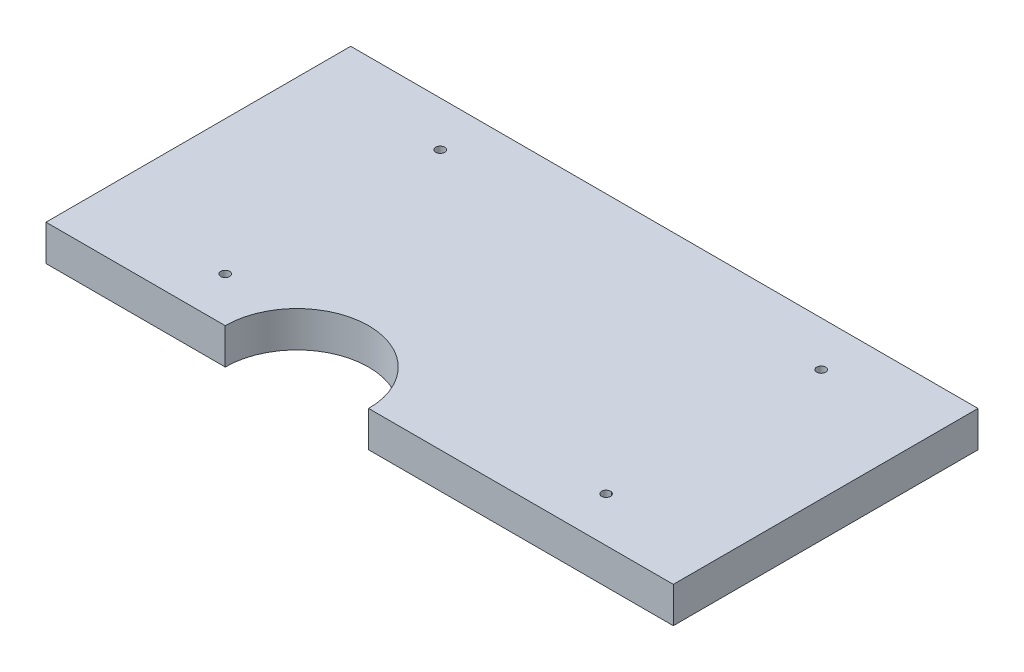
ISO-10303-21;
HEADER;
FILE_DESCRIPTION(('STEP AP214'),'2;1');
FILE_NAME('part.step','',(''),(''),'','','');
FILE_SCHEMA(('AUTOMOTIVE_DESIGN { 1 0 10303 214 1 1 1 1 }'));
ENDSEC;
DATA;
#1=APPLICATION_CONTEXT('core data for automotive mechanical design processes');
#2=APPLICATION_PROTOCOL_DEFINITION('international standard','automotive_design',2000,#1);
#3=PRODUCT_CONTEXT('',#1,'mechanical');
#4=PRODUCT('Part','Part','',(#3));
#5=PRODUCT_RELATED_PRODUCT_CATEGORY('part','',(#4));
#6=PRODUCT_DEFINITION_FORMATION('','',#4);
#7=PRODUCT_DEFINITION_CONTEXT('part definition',#1,'design');
#8=PRODUCT_DEFINITION('design','',#6,#7);
#9=PRODUCT_DEFINITION_SHAPE('','',#8);
#10=(LENGTH_UNIT() NAMED_UNIT(*) SI_UNIT(.MILLI.,.METRE.));
#11=(NAMED_UNIT(*) PLANE_ANGLE_UNIT() SI_UNIT($,.RADIAN.));
#12=(NAMED_UNIT(*) SI_UNIT($,.STERADIAN.) SOLID_ANGLE_UNIT());
#13=UNCERTAINTY_MEASURE_WITH_UNIT(LENGTH_MEASURE(1.E-05),#10,'distance_accuracy_value','');
#14=(GEOMETRIC_REPRESENTATION_CONTEXT(3) GLOBAL_UNCERTAINTY_ASSIGNED_CONTEXT((#13)) GLOBAL_UNIT_ASSIGNED_CONTEXT((#10,
#11,#12)) REPRESENTATION_CONTEXT('',''));
#15=CARTESIAN_POINT('',(0.,0.,0.));
#16=DIRECTION('',(0.,0.,1.));
#17=DIRECTION('',(1.,0.,0.));
#18=AXIS2_PLACEMENT_3D('',#15,#16,#17);
#19=CARTESIAN_POINT('',(-6.67533906368843,8.,25.2536740033262));
#20=DIRECTION('',(0.,1.,0.));
#21=DIRECTION('',(0.,0.,1.));
#22=AXIS2_PLACEMENT_3D('',#19,#20,#21);
#23=PLANE('',#22);
#24=CARTESIAN_POINT('',(52.3246609363116,8.,-32.7463259966738));
#25=DIRECTION('',(0.,1.,0.));
#26=DIRECTION('',(0.,0.,1.));
#27=AXIS2_PLACEMENT_3D('',#24,#25,#26);
#28=CIRCLE('',#27,0.999999999999998);
#29=CARTESIAN_POINT('',(52.3246609363116,8.,-31.7463259966738));
#30=VERTEX_POINT('',#29);
#31=EDGE_CURVE('E188',#30,#30,#28,.T.);
#32=ORIENTED_EDGE('',*,*,#31,.F.);
#33=EDGE_LOOP('',(#32));
#34=FACE_BOUND('',#33,.T.);
#35=CARTESIAN_POINT('',(-32.6753390636884,8.,-32.7463259966738));
#36=DIRECTION('',(0.,1.,0.));
#37=DIRECTION('',(0.,0.,1.));
#38=AXIS2_PLACEMENT_3D('',#35,#36,#37);
#39=CIRCLE('',#38,0.999999999999998);
#40=CARTESIAN_POINT('',(-32.6753390636884,8.,-31.7463259966738));
#41=VERTEX_POINT('',#40);
#42=EDGE_CURVE('E121',#41,#41,#39,.T.);
#43=ORIENTED_EDGE('',*,*,#42,.F.);
#44=EDGE_LOOP('',(#43));
#45=FACE_BOUND('',#44,.T.);
#46=DIRECTION('',(0.,0.,1.));
#47=VECTOR('',#46,1.);
#48=CARTESIAN_POINT('',(-62.6753390636884,8.,-42.7463259966738));
#49=LINE('',#48,#47);
#50=CARTESIAN_POINT('',(-62.6753390636884,8.,-42.7463259966738));
#51=VERTEX_POINT('',#50);
#52=CARTESIAN_POINT('',(-62.6753390636884,8.,25.2536740033262));
#53=VERTEX_POINT('',#52);
#54=EDGE_CURVE('E128',#51,#53,#49,.T.);
#55=ORIENTED_EDGE('',*,*,#54,.T.);
#56=DIRECTION('',(1.,0.,0.));
#57=VECTOR('',#56,1.);
#58=CARTESIAN_POINT('',(-62.6753390636884,8.,25.2536740033262));
#59=LINE('',#58,#57);
#60=CARTESIAN_POINT('',(-22.6753390636884,8.,25.2536740033262));
#61=VERTEX_POINT('',#60);
#62=EDGE_CURVE('E86',#53,#61,#59,.T.);
#63=ORIENTED_EDGE('',*,*,#62,.T.);
#64=CARTESIAN_POINT('',(-6.67533906368843,8.,25.2536740033262));
#65=DIRECTION('',(0.,-1.,0.));
#66=DIRECTION('',(0.,0.,1.));
#67=AXIS2_PLACEMENT_3D('',#64,#65,#66);
#68=CIRCLE('',#67,16.);
#69=CARTESIAN_POINT('',(9.32466093631158,8.,25.2536740033262));
#70=VERTEX_POINT('',#69);
#71=EDGE_CURVE('E99',#61,#70,#68,.T.);
#72=ORIENTED_EDGE('',*,*,#71,.T.);
#73=DIRECTION('',(1.,0.,0.));
#74=VECTOR('',#73,1.);
#75=CARTESIAN_POINT('',(9.32466093631158,8.,25.2536740033262));
#76=LINE('',#75,#74);
#77=CARTESIAN_POINT('',(77.3246609363116,8.,25.2536740033262));
#78=VERTEX_POINT('',#77);
#79=EDGE_CURVE('E93',#70,#78,#76,.T.);
#80=ORIENTED_EDGE('',*,*,#79,.T.);
#81=DIRECTION('',(0.,0.,-1.));
#82=VECTOR('',#81,1.);
#83=CARTESIAN_POINT('',(77.3246609363116,8.,-42.7463259966738));
#84=LINE('',#83,#82);
#85=CARTESIAN_POINT('',(77.3246609363116,8.,-42.7463259966738));
#86=VERTEX_POINT('',#85);
#87=EDGE_CURVE('E97',#78,#86,#84,.T.);
#88=ORIENTED_EDGE('',*,*,#87,.T.);
#89=DIRECTION('',(-1.,0.,0.));
#90=VECTOR('',#89,1.);
#91=CARTESIAN_POINT('',(-62.6753390636884,8.,-42.7463259966738));
#92=LINE('',#91,#90);
#93=EDGE_CURVE('E49',#86,#51,#92,.T.);
#94=ORIENTED_EDGE('',*,*,#93,.T.);
#95=EDGE_LOOP('',(#55,#63,#72,#80,#88,#94));
#96=FACE_BOUND('',#95,.T.);
#97=CARTESIAN_POINT('',(-32.6753390636884,8.,15.2536740033262));
#98=DIRECTION('',(0.,1.,0.));
#99=DIRECTION('',(0.,0.,1.));
#100=AXIS2_PLACEMENT_3D('',#97,#98,#99);
#101=CIRCLE('',#100,0.999999999999998);
#102=CARTESIAN_POINT('',(-32.6753390636884,8.,16.2536740033262));
#103=VERTEX_POINT('',#102);
#104=EDGE_CURVE('E194',#103,#103,#101,.T.);
#105=ORIENTED_EDGE('',*,*,#104,.F.);
#106=EDGE_LOOP('',(#105));
#107=FACE_BOUND('',#106,.T.);
#108=CARTESIAN_POINT('',(52.3246609363116,8.,15.2536740033262));
#109=DIRECTION('',(0.,1.,0.));
#110=DIRECTION('',(0.,0.,1.));
#111=AXIS2_PLACEMENT_3D('',#108,#109,#110);
#112=CIRCLE('',#111,0.999999999999998);
#113=CARTESIAN_POINT('',(52.3246609363116,8.,16.2536740033262));
#114=VERTEX_POINT('',#113);
#115=EDGE_CURVE('E179',#114,#114,#112,.T.);
#116=ORIENTED_EDGE('',*,*,#115,.F.);
#117=EDGE_LOOP('',(#116));
#118=FACE_BOUND('',#117,.T.);
#119=ADVANCED_FACE('F32',(#34,#45,#96,#107,#118),#23,.T.);
#120=CARTESIAN_POINT('',(-6.67533906368843,0.,25.2536740033262));
#121=DIRECTION('',(0.,1.,0.));
#122=DIRECTION('',(0.,0.,1.));
#123=AXIS2_PLACEMENT_3D('',#120,#121,#122);
#124=PLANE('',#123);
#125=DIRECTION('',(0.,0.,1.));
#126=VECTOR('',#125,1.);
#127=CARTESIAN_POINT('',(-62.6753390636884,0.,-42.7463259966738));
#128=LINE('',#127,#126);
#129=CARTESIAN_POINT('',(-62.6753390636884,0.,-42.7463259966738));
#130=VERTEX_POINT('',#129);
#131=CARTESIAN_POINT('',(-62.6753390636884,0.,25.2536740033262));
#132=VERTEX_POINT('',#131);
#133=EDGE_CURVE('E117',#130,#132,#128,.T.);
#134=ORIENTED_EDGE('',*,*,#133,.F.);
#135=DIRECTION('',(-1.,0.,0.));
#136=VECTOR('',#135,1.);
#137=CARTESIAN_POINT('',(-62.6753390636884,0.,-42.7463259966738));
#138=LINE('',#137,#136);
#139=CARTESIAN_POINT('',(77.3246609363116,0.,-42.7463259966738));
#140=VERTEX_POINT('',#139);
#141=EDGE_CURVE('E78',#140,#130,#138,.T.);
#142=ORIENTED_EDGE('',*,*,#141,.F.);
#143=DIRECTION('',(0.,0.,-1.));
#144=VECTOR('',#143,1.);
#145=CARTESIAN_POINT('',(77.3246609363116,0.,-42.7463259966738));
#146=LINE('',#145,#144);
#147=CARTESIAN_POINT('',(77.3246609363116,0.,25.2536740033262));
#148=VERTEX_POINT('',#147);
#149=EDGE_CURVE('E72',#148,#140,#146,.T.);
#150=ORIENTED_EDGE('',*,*,#149,.F.);
#151=DIRECTION('',(1.,0.,0.));
#152=VECTOR('',#151,1.);
#153=CARTESIAN_POINT('',(9.32466093631158,0.,25.2536740033262));
#154=LINE('',#153,#152);
#155=CARTESIAN_POINT('',(9.32466093631158,0.,25.2536740033262));
#156=VERTEX_POINT('',#155);
#157=EDGE_CURVE('E107',#156,#148,#154,.T.);
#158=ORIENTED_EDGE('',*,*,#157,.F.);
#159=CARTESIAN_POINT('',(-6.67533906368843,0.,25.2536740033262));
#160=DIRECTION('',(0.,-1.,0.));
#161=DIRECTION('',(0.,0.,1.));
#162=AXIS2_PLACEMENT_3D('',#159,#160,#161);
#163=CIRCLE('',#162,16.);
#164=CARTESIAN_POINT('',(-22.6753390636884,0.,25.2536740033262));
#165=VERTEX_POINT('',#164);
#166=EDGE_CURVE('E123',#165,#156,#163,.T.);
#167=ORIENTED_EDGE('',*,*,#166,.F.);
#168=DIRECTION('',(1.,0.,0.));
#169=VECTOR('',#168,1.);
#170=CARTESIAN_POINT('',(-62.6753390636884,0.,25.2536740033262));
#171=LINE('',#170,#169);
#172=EDGE_CURVE('E120',#132,#165,#171,.T.);
#173=ORIENTED_EDGE('',*,*,#172,.F.);
#174=EDGE_LOOP('',(#134,#142,#150,#158,#167,#173));
#175=FACE_BOUND('',#174,.T.);
#176=CARTESIAN_POINT('',(-32.6753390636884,0.,-32.7463259966738));
#177=DIRECTION('',(0.,1.,0.));
#178=DIRECTION('',(0.,0.,1.));
#179=AXIS2_PLACEMENT_3D('',#176,#177,#178);
#180=CIRCLE('',#179,0.999999999999998);
#181=CARTESIAN_POINT('',(-32.6753390636884,0.,-31.7463259966738));
#182=VERTEX_POINT('',#181);
#183=EDGE_CURVE('E197',#182,#182,#180,.T.);
#184=ORIENTED_EDGE('',*,*,#183,.T.);
#185=EDGE_LOOP('',(#184));
#186=FACE_BOUND('',#185,.T.);
#187=CARTESIAN_POINT('',(-32.6753390636884,0.,15.2536740033262));
#188=DIRECTION('',(0.,1.,0.));
#189=DIRECTION('',(0.,0.,1.));
#190=AXIS2_PLACEMENT_3D('',#187,#188,#189);
#191=CIRCLE('',#190,0.999999999999998);
#192=CARTESIAN_POINT('',(-32.6753390636884,0.,16.2536740033262));
#193=VERTEX_POINT('',#192);
#194=EDGE_CURVE('E191',#193,#193,#191,.T.);
#195=ORIENTED_EDGE('',*,*,#194,.T.);
#196=EDGE_LOOP('',(#195));
#197=FACE_BOUND('',#196,.T.);
#198=CARTESIAN_POINT('',(52.3246609363116,0.,-32.7463259966738));
#199=DIRECTION('',(0.,1.,0.));
#200=DIRECTION('',(0.,0.,1.));
#201=AXIS2_PLACEMENT_3D('',#198,#199,#200);
#202=CIRCLE('',#201,0.999999999999998);
#203=CARTESIAN_POINT('',(52.3246609363116,0.,-31.7463259966738));
#204=VERTEX_POINT('',#203);
#205=EDGE_CURVE('E185',#204,#204,#202,.T.);
#206=ORIENTED_EDGE('',*,*,#205,.T.);
#207=EDGE_LOOP('',(#206));
#208=FACE_BOUND('',#207,.T.);
#209=CARTESIAN_POINT('',(52.3246609363116,0.,15.2536740033262));
#210=DIRECTION('',(0.,1.,0.));
#211=DIRECTION('',(0.,0.,1.));
#212=AXIS2_PLACEMENT_3D('',#209,#210,#211);
#213=CIRCLE('',#212,0.999999999999998);
#214=CARTESIAN_POINT('',(52.3246609363116,0.,16.2536740033262));
#215=VERTEX_POINT('',#214);
#216=EDGE_CURVE('E182',#215,#215,#213,.T.);
#217=ORIENTED_EDGE('',*,*,#216,.T.);
#218=EDGE_LOOP('',(#217));
#219=FACE_BOUND('',#218,.T.);
#220=ADVANCED_FACE('F137',(#175,#186,#197,#208,#219),#124,.F.);
#221=CARTESIAN_POINT('',(-62.6753390636884,8.,-42.7463259966738));
#222=DIRECTION('',(1.,0.,0.));
#223=DIRECTION('',(0.,0.,-1.));
#224=AXIS2_PLACEMENT_3D('',#221,#222,#223);
#225=PLANE('',#224);
#226=ORIENTED_EDGE('',*,*,#133,.T.);
#227=DIRECTION('',(0.,-1.,0.));
#228=VECTOR('',#227,1.);
#229=CARTESIAN_POINT('',(-62.6753390636884,8.,25.2536740033262));
#230=LINE('',#229,#228);
#231=EDGE_CURVE('E11',#53,#132,#230,.T.);
#232=ORIENTED_EDGE('',*,*,#231,.F.);
#233=ORIENTED_EDGE('',*,*,#54,.F.);
#234=DIRECTION('',(0.,-1.,0.));
#235=VECTOR('',#234,1.);
#236=CARTESIAN_POINT('',(-62.6753390636884,8.,-42.7463259966738));
#237=LINE('',#236,#235);
#238=EDGE_CURVE('E113',#51,#130,#237,.T.);
#239=ORIENTED_EDGE('',*,*,#238,.T.);
#240=EDGE_LOOP('',(#226,#232,#233,#239));
#241=FACE_BOUND('',#240,.T.);
#242=ADVANCED_FACE('F34',(#241),#225,.F.);
#243=CARTESIAN_POINT('',(-62.6753390636884,8.,25.2536740033262));
#244=DIRECTION('',(0.,0.,-1.));
#245=DIRECTION('',(-1.,0.,0.));
#246=AXIS2_PLACEMENT_3D('',#243,#244,#245);
#247=PLANE('',#246);
#248=ORIENTED_EDGE('',*,*,#172,.T.);
#249=DIRECTION('',(0.,-1.,0.));
#250=VECTOR('',#249,1.);
#251=CARTESIAN_POINT('',(-22.6753390636884,8.,25.2536740033262));
#252=LINE('',#251,#250);
#253=EDGE_CURVE('E41',#61,#165,#252,.T.);
#254=ORIENTED_EDGE('',*,*,#253,.F.);
#255=ORIENTED_EDGE('',*,*,#62,.F.);
#256=ORIENTED_EDGE('',*,*,#231,.T.);
#257=EDGE_LOOP('',(#248,#254,#255,#256));
#258=FACE_BOUND('',#257,.T.);
#259=ADVANCED_FACE('F255',(#258),#247,.F.);
#260=CARTESIAN_POINT('',(-6.67533906368843,8.,25.2536740033262));
#261=DIRECTION('',(0.,-1.,0.));
#262=DIRECTION('',(0.,0.,-1.));
#263=AXIS2_PLACEMENT_3D('',#260,#261,#262);
#264=CYLINDRICAL_SURFACE('',#263,16.);
#265=ORIENTED_EDGE('',*,*,#166,.T.);
#266=DIRECTION('',(0.,-1.,0.));
#267=VECTOR('',#266,1.);
#268=CARTESIAN_POINT('',(9.32466093631158,8.,25.2536740033262));
#269=LINE('',#268,#267);
#270=EDGE_CURVE('E108',#70,#156,#269,.T.);
#271=ORIENTED_EDGE('',*,*,#270,.F.);
#272=ORIENTED_EDGE('',*,*,#71,.F.);
#273=ORIENTED_EDGE('',*,*,#253,.T.);
#274=EDGE_LOOP('',(#265,#271,#272,#273));
#275=FACE_BOUND('',#274,.T.);
#276=ADVANCED_FACE('F134',(#275),#264,.F.);
#277=CARTESIAN_POINT('',(9.32466093631158,8.,25.2536740033262));
#278=DIRECTION('',(0.,0.,-1.));
#279=DIRECTION('',(-1.,0.,0.));
#280=AXIS2_PLACEMENT_3D('',#277,#278,#279);
#281=PLANE('',#280);
#282=ORIENTED_EDGE('',*,*,#157,.T.);
#283=DIRECTION('',(0.,-1.,0.));
#284=VECTOR('',#283,1.);
#285=CARTESIAN_POINT('',(77.3246609363116,8.,25.2536740033262));
#286=LINE('',#285,#284);
#287=EDGE_CURVE('E104',#78,#148,#286,.T.);
#288=ORIENTED_EDGE('',*,*,#287,.F.);
#289=ORIENTED_EDGE('',*,*,#79,.F.);
#290=ORIENTED_EDGE('',*,*,#270,.T.);
#291=EDGE_LOOP('',(#282,#288,#289,#290));
#292=FACE_BOUND('',#291,.T.);
#293=ADVANCED_FACE('F105',(#292),#281,.F.);
#294=CARTESIAN_POINT('',(77.3246609363116,8.,-42.7463259966738));
#295=DIRECTION('',(-1.,0.,0.));
#296=DIRECTION('',(0.,0.,1.));
#297=AXIS2_PLACEMENT_3D('',#294,#295,#296);
#298=PLANE('',#297);
#299=ORIENTED_EDGE('',*,*,#149,.T.);
#300=DIRECTION('',(0.,-1.,0.));
#301=VECTOR('',#300,1.);
#302=CARTESIAN_POINT('',(77.3246609363116,8.,-42.7463259966738));
#303=LINE('',#302,#301);
#304=EDGE_CURVE('E109',#86,#140,#303,.T.);
#305=ORIENTED_EDGE('',*,*,#304,.F.);
#306=ORIENTED_EDGE('',*,*,#87,.F.);
#307=ORIENTED_EDGE('',*,*,#287,.T.);
#308=EDGE_LOOP('',(#299,#305,#306,#307));
#309=FACE_BOUND('',#308,.T.);
#310=ADVANCED_FACE('F111',(#309),#298,.F.);
#311=CARTESIAN_POINT('',(-62.6753390636884,8.,-42.7463259966738));
#312=DIRECTION('',(0.,0.,1.));
#313=DIRECTION('',(1.,0.,0.));
#314=AXIS2_PLACEMENT_3D('',#311,#312,#313);
#315=PLANE('',#314);
#316=ORIENTED_EDGE('',*,*,#141,.T.);
#317=ORIENTED_EDGE('',*,*,#238,.F.);
#318=ORIENTED_EDGE('',*,*,#93,.F.);
#319=ORIENTED_EDGE('',*,*,#304,.T.);
#320=EDGE_LOOP('',(#316,#317,#318,#319));
#321=FACE_BOUND('',#320,.T.);
#322=ADVANCED_FACE('F142',(#321),#315,.F.);
#323=CARTESIAN_POINT('',(-32.6753390636884,8.,-32.7463259966738));
#324=DIRECTION('',(0.,-1.,0.));
#325=DIRECTION('',(0.,0.,-1.));
#326=AXIS2_PLACEMENT_3D('',#323,#324,#325);
#327=CYLINDRICAL_SURFACE('',#326,0.999999999999998);
#328=ORIENTED_EDGE('',*,*,#42,.T.);
#329=EDGE_LOOP('',(#328));
#330=FACE_BOUND('',#329,.T.);
#331=ORIENTED_EDGE('',*,*,#183,.F.);
#332=EDGE_LOOP('',(#331));
#333=FACE_BOUND('',#332,.T.);
#334=ADVANCED_FACE('F144',(#330,#333),#327,.F.);
#335=CARTESIAN_POINT('',(-32.6753390636884,8.,15.2536740033262));
#336=DIRECTION('',(0.,-1.,0.));
#337=DIRECTION('',(0.,0.,-1.));
#338=AXIS2_PLACEMENT_3D('',#335,#336,#337);
#339=CYLINDRICAL_SURFACE('',#338,0.999999999999998);
#340=ORIENTED_EDGE('',*,*,#104,.T.);
#341=EDGE_LOOP('',(#340));
#342=FACE_BOUND('',#341,.T.);
#343=ORIENTED_EDGE('',*,*,#194,.F.);
#344=EDGE_LOOP('',(#343));
#345=FACE_BOUND('',#344,.T.);
#346=ADVANCED_FACE('F150',(#342,#345),#339,.F.);
#347=CARTESIAN_POINT('',(52.3246609363116,8.,-32.7463259966738));
#348=DIRECTION('',(0.,-1.,0.));
#349=DIRECTION('',(0.,0.,-1.));
#350=AXIS2_PLACEMENT_3D('',#347,#348,#349);
#351=CYLINDRICAL_SURFACE('',#350,0.999999999999998);
#352=ORIENTED_EDGE('',*,*,#31,.T.);
#353=EDGE_LOOP('',(#352));
#354=FACE_BOUND('',#353,.T.);
#355=ORIENTED_EDGE('',*,*,#205,.F.);
#356=EDGE_LOOP('',(#355));
#357=FACE_BOUND('',#356,.T.);
#358=ADVANCED_FACE('F166',(#354,#357),#351,.F.);
#359=CARTESIAN_POINT('',(52.3246609363116,8.,15.2536740033262));
#360=DIRECTION('',(0.,-1.,0.));
#361=DIRECTION('',(0.,0.,-1.));
#362=AXIS2_PLACEMENT_3D('',#359,#360,#361);
#363=CYLINDRICAL_SURFACE('',#362,0.999999999999998);
#364=ORIENTED_EDGE('',*,*,#115,.T.);
#365=EDGE_LOOP('',(#364));
#366=FACE_BOUND('',#365,.T.);
#367=ORIENTED_EDGE('',*,*,#216,.F.);
#368=EDGE_LOOP('',(#367));
#369=FACE_BOUND('',#368,.T.);
#370=ADVANCED_FACE('F170',(#366,#369),#363,.F.);
#371=CLOSED_SHELL('',(#119,#220,#242,#259,#276,#293,#310,#322,#334,#346,#358,#370));
#372=MANIFOLD_SOLID_BREP('B2',#371);
#373=ADVANCED_BREP_SHAPE_REPRESENTATION('',(#18,#372),#14);
#374=SHAPE_DEFINITION_REPRESENTATION(#9,#373);
ENDSEC;
END-ISO-10303-21;
